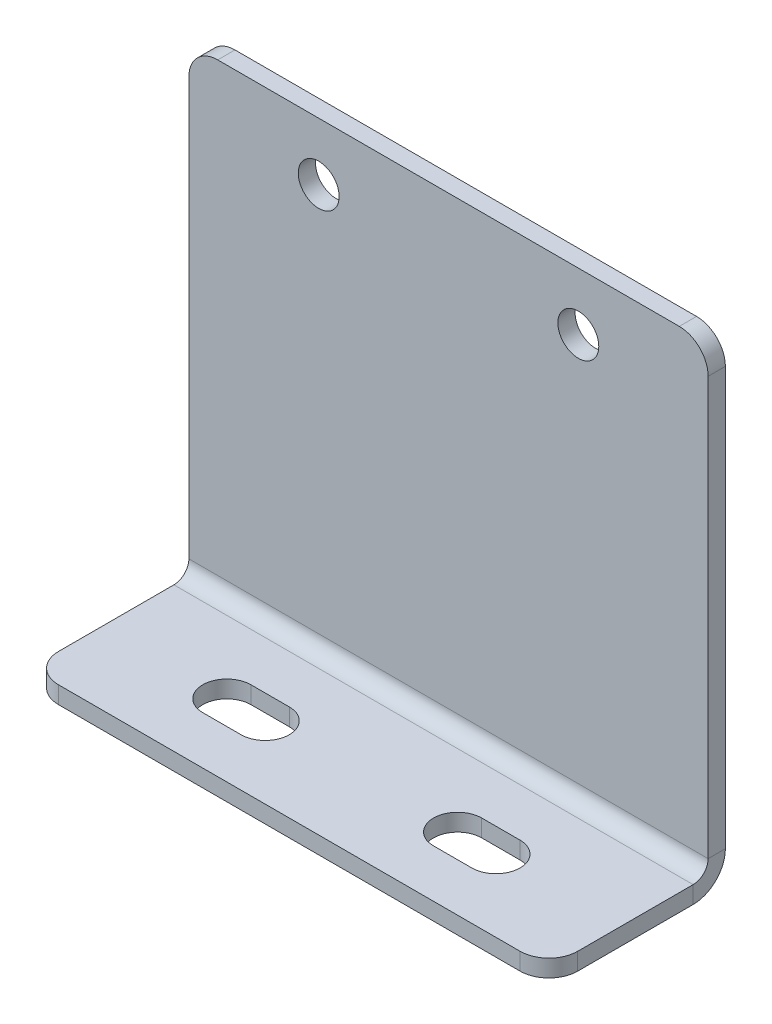
ISO-10303-21;
HEADER;
FILE_DESCRIPTION(('STEP AP214'),'2;1');
FILE_NAME('part.step','',(''),(''),'','','');
FILE_SCHEMA(('AUTOMOTIVE_DESIGN { 1 0 10303 214 1 1 1 1 }'));
ENDSEC;
DATA;
#1=APPLICATION_CONTEXT('core data for automotive mechanical design processes');
#2=APPLICATION_PROTOCOL_DEFINITION('international standard','automotive_design',2000,#1);
#3=PRODUCT_CONTEXT('',#1,'mechanical');
#4=PRODUCT('Part','Part','',(#3));
#5=PRODUCT_RELATED_PRODUCT_CATEGORY('part','',(#4));
#6=PRODUCT_DEFINITION_FORMATION('','',#4);
#7=PRODUCT_DEFINITION_CONTEXT('part definition',#1,'design');
#8=PRODUCT_DEFINITION('design','',#6,#7);
#9=PRODUCT_DEFINITION_SHAPE('','',#8);
#10=(LENGTH_UNIT() NAMED_UNIT(*) SI_UNIT(.MILLI.,.METRE.));
#11=(NAMED_UNIT(*) PLANE_ANGLE_UNIT() SI_UNIT($,.RADIAN.));
#12=(NAMED_UNIT(*) SI_UNIT($,.STERADIAN.) SOLID_ANGLE_UNIT());
#13=UNCERTAINTY_MEASURE_WITH_UNIT(LENGTH_MEASURE(1.E-05),#10,'distance_accuracy_value','');
#14=(GEOMETRIC_REPRESENTATION_CONTEXT(3) GLOBAL_UNCERTAINTY_ASSIGNED_CONTEXT((#13)) GLOBAL_UNIT_ASSIGNED_CONTEXT((#10,
#11,#12)) REPRESENTATION_CONTEXT('',''));
#15=CARTESIAN_POINT('',(0.,0.,0.));
#16=DIRECTION('',(0.,0.,1.));
#17=DIRECTION('',(1.,0.,0.));
#18=AXIS2_PLACEMENT_3D('',#15,#16,#17);
#19=CARTESIAN_POINT('',(0.,0.,0.));
#20=DIRECTION('',(0.,-1.,0.));
#21=DIRECTION('',(0.,0.,-1.));
#22=AXIS2_PLACEMENT_3D('',#19,#20,#21);
#23=PLANE('',#22);
#24=DIRECTION('',(1.,0.,0.));
#25=VECTOR('',#24,1.);
#26=CARTESIAN_POINT('',(0.,0.,0.));
#27=LINE('',#26,#25);
#28=CARTESIAN_POINT('',(3.175,0.,0.));
#29=VERTEX_POINT('',#28);
#30=CARTESIAN_POINT('',(53.975,0.,0.));
#31=VERTEX_POINT('',#30);
#32=EDGE_CURVE('E482',#29,#31,#27,.T.);
#33=ORIENTED_EDGE('',*,*,#32,.T.);
#34=CARTESIAN_POINT('',(53.975,0.,-3.175));
#35=DIRECTION('',(0.,-1.,0.));
#36=DIRECTION('',(0.,0.,-1.));
#37=AXIS2_PLACEMENT_3D('',#34,#35,#36);
#38=CIRCLE('',#37,3.175);
#39=CARTESIAN_POINT('',(57.15,0.,-3.175));
#40=VERTEX_POINT('',#39);
#41=EDGE_CURVE('E501',#31,#40,#38,.F.);
#42=ORIENTED_EDGE('',*,*,#41,.T.);
#43=DIRECTION('',(0.,0.,-1.));
#44=VECTOR('',#43,1.);
#45=CARTESIAN_POINT('',(57.15,0.,0.));
#46=LINE('',#45,#44);
#47=CARTESIAN_POINT('',(57.15,0.,-15.875));
#48=VERTEX_POINT('',#47);
#49=EDGE_CURVE('E485',#40,#48,#46,.T.);
#50=ORIENTED_EDGE('',*,*,#49,.T.);
#51=DIRECTION('',(-1.,0.,0.));
#52=VECTOR('',#51,1.);
#53=CARTESIAN_POINT('',(0.,0.,-15.875));
#54=LINE('',#53,#52);
#55=CARTESIAN_POINT('',(0.,0.,-15.875));
#56=VERTEX_POINT('',#55);
#57=EDGE_CURVE('E471',#48,#56,#54,.T.);
#58=ORIENTED_EDGE('',*,*,#57,.T.);
#59=DIRECTION('',(0.,0.,1.));
#60=VECTOR('',#59,1.);
#61=CARTESIAN_POINT('',(0.,0.,0.));
#62=LINE('',#61,#60);
#63=CARTESIAN_POINT('',(0.,0.,-3.175));
#64=VERTEX_POINT('',#63);
#65=EDGE_CURVE('E458',#56,#64,#62,.T.);
#66=ORIENTED_EDGE('',*,*,#65,.T.);
#67=CARTESIAN_POINT('',(3.175,0.,-3.175));
#68=DIRECTION('',(0.,-1.,0.));
#69=DIRECTION('',(0.,0.,-1.));
#70=AXIS2_PLACEMENT_3D('',#67,#68,#69);
#71=CIRCLE('',#70,3.175);
#72=EDGE_CURVE('E499',#64,#29,#71,.F.);
#73=ORIENTED_EDGE('',*,*,#72,.T.);
#74=EDGE_LOOP('',(#33,#42,#50,#58,#66,#73));
#75=FACE_BOUND('',#74,.T.);
#76=DIRECTION('',(1.,0.,0.));
#77=VECTOR('',#76,1.);
#78=CARTESIAN_POINT('',(39.1668,0.,-10.5918));
#79=LINE('',#78,#77);
#80=CARTESIAN_POINT('',(39.1668,0.,-10.5918));
#81=VERTEX_POINT('',#80);
#82=CARTESIAN_POINT('',(43.3832,0.,-10.5918));
#83=VERTEX_POINT('',#82);
#84=EDGE_CURVE('E407',#81,#83,#79,.T.);
#85=ORIENTED_EDGE('',*,*,#84,.T.);
#86=CARTESIAN_POINT('',(43.3832,0.,-7.9375));
#87=DIRECTION('',(0.,1.,0.));
#88=DIRECTION('',(0.,0.,1.));
#89=AXIS2_PLACEMENT_3D('',#86,#87,#88);
#90=CIRCLE('',#89,2.6543);
#91=CARTESIAN_POINT('',(43.3832,0.,-5.28320000000003));
#92=VERTEX_POINT('',#91);
#93=EDGE_CURVE('E420',#92,#83,#90,.T.);
#94=ORIENTED_EDGE('',*,*,#93,.F.);
#95=DIRECTION('',(1.,0.,0.));
#96=VECTOR('',#95,1.);
#97=CARTESIAN_POINT('',(39.1668,0.,-5.28320000000003));
#98=LINE('',#97,#96);
#99=CARTESIAN_POINT('',(39.1668,0.,-5.2832));
#100=VERTEX_POINT('',#99);
#101=EDGE_CURVE('E399',#100,#92,#98,.T.);
#102=ORIENTED_EDGE('',*,*,#101,.F.);
#103=CARTESIAN_POINT('',(39.1668,0.,-7.9375));
#104=DIRECTION('',(0.,1.,0.));
#105=DIRECTION('',(0.,0.,1.));
#106=AXIS2_PLACEMENT_3D('',#103,#104,#105);
#107=CIRCLE('',#106,2.6543);
#108=EDGE_CURVE('E410',#81,#100,#107,.T.);
#109=ORIENTED_EDGE('',*,*,#108,.F.);
#110=EDGE_LOOP('',(#85,#94,#102,#109));
#111=FACE_BOUND('',#110,.T.);
#112=DIRECTION('',(1.,0.,0.));
#113=VECTOR('',#112,1.);
#114=CARTESIAN_POINT('',(13.7668,0.,-5.28320000000003));
#115=LINE('',#114,#113);
#116=CARTESIAN_POINT('',(13.7668,0.,-5.2832));
#117=VERTEX_POINT('',#116);
#118=CARTESIAN_POINT('',(17.9832,0.,-5.28320000000003));
#119=VERTEX_POINT('',#118);
#120=EDGE_CURVE('E385',#117,#119,#115,.T.);
#121=ORIENTED_EDGE('',*,*,#120,.F.);
#122=CARTESIAN_POINT('',(13.7668,0.,-7.9375));
#123=DIRECTION('',(0.,1.,0.));
#124=DIRECTION('',(0.,0.,1.));
#125=AXIS2_PLACEMENT_3D('',#122,#123,#124);
#126=CIRCLE('',#125,2.6543);
#127=CARTESIAN_POINT('',(13.7668,0.,-10.5918));
#128=VERTEX_POINT('',#127);
#129=EDGE_CURVE('E372',#128,#117,#126,.T.);
#130=ORIENTED_EDGE('',*,*,#129,.F.);
#131=DIRECTION('',(1.,0.,0.));
#132=VECTOR('',#131,1.);
#133=CARTESIAN_POINT('',(13.7668,0.,-10.5918));
#134=LINE('',#133,#132);
#135=CARTESIAN_POINT('',(17.9832,0.,-10.5918));
#136=VERTEX_POINT('',#135);
#137=EDGE_CURVE('E362',#128,#136,#134,.T.);
#138=ORIENTED_EDGE('',*,*,#137,.T.);
#139=CARTESIAN_POINT('',(17.9832,0.,-7.9375));
#140=DIRECTION('',(0.,1.,0.));
#141=DIRECTION('',(0.,0.,1.));
#142=AXIS2_PLACEMENT_3D('',#139,#140,#141);
#143=CIRCLE('',#142,2.6543);
#144=EDGE_CURVE('E382',#119,#136,#143,.T.);
#145=ORIENTED_EDGE('',*,*,#144,.F.);
#146=EDGE_LOOP('',(#121,#130,#138,#145));
#147=FACE_BOUND('',#146,.T.);
#148=ADVANCED_FACE('F222',(#75,#111,#147),#23,.F.);
#149=CARTESIAN_POINT('',(0.,-1.89738,0.));
#150=DIRECTION('',(0.,-1.,0.));
#151=DIRECTION('',(0.,0.,-1.));
#152=AXIS2_PLACEMENT_3D('',#149,#150,#151);
#153=PLANE('',#152);
#154=CARTESIAN_POINT('',(17.9832,-1.89738000000002,-7.9375));
#155=DIRECTION('',(0.,1.,0.));
#156=DIRECTION('',(0.,0.,1.));
#157=AXIS2_PLACEMENT_3D('',#154,#155,#156);
#158=CIRCLE('',#157,2.6543);
#159=CARTESIAN_POINT('',(17.9832,-1.89738000000002,-5.2832));
#160=VERTEX_POINT('',#159);
#161=CARTESIAN_POINT('',(17.9832,-1.89738000000002,-10.5918));
#162=VERTEX_POINT('',#161);
#163=EDGE_CURVE('E392',#160,#162,#158,.T.);
#164=ORIENTED_EDGE('',*,*,#163,.T.);
#165=DIRECTION('',(1.,0.,0.));
#166=VECTOR('',#165,1.);
#167=CARTESIAN_POINT('',(13.7668,-1.89738000000002,-10.5918));
#168=LINE('',#167,#166);
#169=CARTESIAN_POINT('',(13.7668,-1.89738000000002,-10.5918));
#170=VERTEX_POINT('',#169);
#171=EDGE_CURVE('E373',#170,#162,#168,.T.);
#172=ORIENTED_EDGE('',*,*,#171,.F.);
#173=CARTESIAN_POINT('',(13.7668,-1.89738000000002,-7.9375));
#174=DIRECTION('',(0.,1.,0.));
#175=DIRECTION('',(0.,0.,1.));
#176=AXIS2_PLACEMENT_3D('',#173,#174,#175);
#177=CIRCLE('',#176,2.6543);
#178=CARTESIAN_POINT('',(13.7668,-1.89738,-5.2832));
#179=VERTEX_POINT('',#178);
#180=EDGE_CURVE('E380',#170,#179,#177,.T.);
#181=ORIENTED_EDGE('',*,*,#180,.T.);
#182=DIRECTION('',(1.,0.,0.));
#183=VECTOR('',#182,1.);
#184=CARTESIAN_POINT('',(13.7668,-1.89738000000002,-5.2832));
#185=LINE('',#184,#183);
#186=EDGE_CURVE('E866',#179,#160,#185,.T.);
#187=ORIENTED_EDGE('',*,*,#186,.T.);
#188=EDGE_LOOP('',(#164,#172,#181,#187));
#189=FACE_BOUND('',#188,.T.);
#190=DIRECTION('',(0.,0.,-1.));
#191=VECTOR('',#190,1.);
#192=CARTESIAN_POINT('',(57.15,-1.89738,0.));
#193=LINE('',#192,#191);
#194=CARTESIAN_POINT('',(57.15,-1.89738,-3.175));
#195=VERTEX_POINT('',#194);
#196=CARTESIAN_POINT('',(57.15,-1.89738,-15.875));
#197=VERTEX_POINT('',#196);
#198=EDGE_CURVE('E474',#195,#197,#193,.T.);
#199=ORIENTED_EDGE('',*,*,#198,.F.);
#200=CARTESIAN_POINT('',(53.975,-1.89738,-3.175));
#201=DIRECTION('',(0.,-1.,0.));
#202=DIRECTION('',(0.,0.,-1.));
#203=AXIS2_PLACEMENT_3D('',#200,#201,#202);
#204=CIRCLE('',#203,3.175);
#205=CARTESIAN_POINT('',(53.975,-1.89738,0.));
#206=VERTEX_POINT('',#205);
#207=EDGE_CURVE('E507',#195,#206,#204,.T.);
#208=ORIENTED_EDGE('',*,*,#207,.T.);
#209=DIRECTION('',(1.,0.,0.));
#210=VECTOR('',#209,1.);
#211=CARTESIAN_POINT('',(0.,-1.89738,0.));
#212=LINE('',#211,#210);
#213=CARTESIAN_POINT('',(3.175,-1.89738,0.));
#214=VERTEX_POINT('',#213);
#215=EDGE_CURVE('E470',#214,#206,#212,.T.);
#216=ORIENTED_EDGE('',*,*,#215,.F.);
#217=CARTESIAN_POINT('',(3.175,-1.89738,-3.175));
#218=DIRECTION('',(0.,-1.,0.));
#219=DIRECTION('',(0.,0.,-1.));
#220=AXIS2_PLACEMENT_3D('',#217,#218,#219);
#221=CIRCLE('',#220,3.175);
#222=CARTESIAN_POINT('',(0.,-1.89738,-3.175));
#223=VERTEX_POINT('',#222);
#224=EDGE_CURVE('E505',#214,#223,#221,.T.);
#225=ORIENTED_EDGE('',*,*,#224,.T.);
#226=DIRECTION('',(0.,0.,1.));
#227=VECTOR('',#226,1.);
#228=CARTESIAN_POINT('',(0.,-1.89738,0.));
#229=LINE('',#228,#227);
#230=CARTESIAN_POINT('',(0.,-1.89738000000002,-15.875));
#231=VERTEX_POINT('',#230);
#232=EDGE_CURVE('E467',#231,#223,#229,.T.);
#233=ORIENTED_EDGE('',*,*,#232,.F.);
#234=DIRECTION('',(-1.,0.,0.));
#235=VECTOR('',#234,1.);
#236=CARTESIAN_POINT('',(0.,-1.89738,-15.875));
#237=LINE('',#236,#235);
#238=EDGE_CURVE('E476',#197,#231,#237,.T.);
#239=ORIENTED_EDGE('',*,*,#238,.F.);
#240=EDGE_LOOP('',(#199,#208,#216,#225,#233,#239));
#241=FACE_BOUND('',#240,.T.);
#242=DIRECTION('',(1.,0.,0.));
#243=VECTOR('',#242,1.);
#244=CARTESIAN_POINT('',(39.1668,-1.89738000000002,-10.5918));
#245=LINE('',#244,#243);
#246=CARTESIAN_POINT('',(39.1668,-1.89738000000002,-10.5918));
#247=VERTEX_POINT('',#246);
#248=CARTESIAN_POINT('',(43.3832,-1.89738,-10.5918));
#249=VERTEX_POINT('',#248);
#250=EDGE_CURVE('E404',#247,#249,#245,.T.);
#251=ORIENTED_EDGE('',*,*,#250,.F.);
#252=CARTESIAN_POINT('',(39.1668,-1.89738000000002,-7.9375));
#253=DIRECTION('',(0.,1.,0.));
#254=DIRECTION('',(0.,0.,1.));
#255=AXIS2_PLACEMENT_3D('',#252,#253,#254);
#256=CIRCLE('',#255,2.6543);
#257=CARTESIAN_POINT('',(39.1668,-1.89738000000002,-5.2832));
#258=VERTEX_POINT('',#257);
#259=EDGE_CURVE('E413',#247,#258,#256,.T.);
#260=ORIENTED_EDGE('',*,*,#259,.T.);
#261=DIRECTION('',(1.,0.,0.));
#262=VECTOR('',#261,1.);
#263=CARTESIAN_POINT('',(39.1668,-1.89738000000002,-5.2832));
#264=LINE('',#263,#262);
#265=CARTESIAN_POINT('',(43.3832,-1.89738000000002,-5.2832));
#266=VERTEX_POINT('',#265);
#267=EDGE_CURVE('E401',#258,#266,#264,.T.);
#268=ORIENTED_EDGE('',*,*,#267,.T.);
#269=CARTESIAN_POINT('',(43.3832,-1.89738000000002,-7.9375));
#270=DIRECTION('',(0.,1.,0.));
#271=DIRECTION('',(0.,0.,1.));
#272=AXIS2_PLACEMENT_3D('',#269,#270,#271);
#273=CIRCLE('',#272,2.6543);
#274=EDGE_CURVE('E423',#266,#249,#273,.T.);
#275=ORIENTED_EDGE('',*,*,#274,.T.);
#276=EDGE_LOOP('',(#251,#260,#268,#275));
#277=FACE_BOUND('',#276,.T.);
#278=ADVANCED_FACE('F573',(#189,#241,#277),#153,.T.);
#279=CARTESIAN_POINT('',(0.,-1.89738,0.));
#280=DIRECTION('',(-1.,0.,0.));
#281=DIRECTION('',(0.,0.,1.));
#282=AXIS2_PLACEMENT_3D('',#279,#280,#281);
#283=PLANE('',#282);
#284=ORIENTED_EDGE('',*,*,#232,.T.);
#285=DIRECTION('',(0.,1.,0.));
#286=VECTOR('',#285,1.);
#287=CARTESIAN_POINT('',(0.,-1.89738,-3.175));
#288=LINE('',#287,#286);
#289=EDGE_CURVE('E16',#223,#64,#288,.T.);
#290=ORIENTED_EDGE('',*,*,#289,.T.);
#291=ORIENTED_EDGE('',*,*,#65,.F.);
#292=DIRECTION('',(0.,1.,0.));
#293=VECTOR('',#292,1.);
#294=CARTESIAN_POINT('',(0.,-1.89738,-15.875));
#295=LINE('',#294,#293);
#296=EDGE_CURVE('E489',#231,#56,#295,.T.);
#297=ORIENTED_EDGE('',*,*,#296,.F.);
#298=EDGE_LOOP('',(#284,#290,#291,#297));
#299=FACE_BOUND('',#298,.T.);
#300=ADVANCED_FACE('F570',(#299),#283,.T.);
#301=CARTESIAN_POINT('',(57.15,-1.89738,0.));
#302=DIRECTION('',(1.,0.,0.));
#303=DIRECTION('',(0.,0.,-1.));
#304=AXIS2_PLACEMENT_3D('',#301,#302,#303);
#305=PLANE('',#304);
#306=ORIENTED_EDGE('',*,*,#49,.F.);
#307=DIRECTION('',(0.,1.,0.));
#308=VECTOR('',#307,1.);
#309=CARTESIAN_POINT('',(57.15,-1.89738,-3.175));
#310=LINE('',#309,#308);
#311=EDGE_CURVE('E503',#40,#195,#310,.F.);
#312=ORIENTED_EDGE('',*,*,#311,.T.);
#313=ORIENTED_EDGE('',*,*,#198,.T.);
#314=DIRECTION('',(0.,1.,0.));
#315=VECTOR('',#314,1.);
#316=CARTESIAN_POINT('',(57.15,-1.89738,-15.875));
#317=LINE('',#316,#315);
#318=EDGE_CURVE('E479',#197,#48,#317,.T.);
#319=ORIENTED_EDGE('',*,*,#318,.T.);
#320=EDGE_LOOP('',(#306,#312,#313,#319));
#321=FACE_BOUND('',#320,.T.);
#322=ADVANCED_FACE('F560',(#321),#305,.T.);
#323=CARTESIAN_POINT('',(0.,-1.89738,0.));
#324=DIRECTION('',(0.,0.,1.));
#325=DIRECTION('',(1.,0.,0.));
#326=AXIS2_PLACEMENT_3D('',#323,#324,#325);
#327=PLANE('',#326);
#328=ORIENTED_EDGE('',*,*,#215,.T.);
#329=DIRECTION('',(0.,1.,0.));
#330=VECTOR('',#329,1.);
#331=CARTESIAN_POINT('',(53.975,-1.89738,0.));
#332=LINE('',#331,#330);
#333=EDGE_CURVE('E496',#206,#31,#332,.T.);
#334=ORIENTED_EDGE('',*,*,#333,.T.);
#335=ORIENTED_EDGE('',*,*,#32,.F.);
#336=DIRECTION('',(0.,1.,0.));
#337=VECTOR('',#336,1.);
#338=CARTESIAN_POINT('',(3.175,-1.89738,0.));
#339=LINE('',#338,#337);
#340=EDGE_CURVE('E492',#29,#214,#339,.F.);
#341=ORIENTED_EDGE('',*,*,#340,.T.);
#342=EDGE_LOOP('',(#328,#334,#335,#341));
#343=FACE_BOUND('',#342,.T.);
#344=ADVANCED_FACE('F582',(#343),#327,.T.);
#345=CARTESIAN_POINT('',(57.15,1.65099999999998,-15.875));
#346=DIRECTION('',(1.,0.,0.));
#347=DIRECTION('',(0.,0.,-1.));
#348=AXIS2_PLACEMENT_3D('',#345,#346,#347);
#349=PLANE('',#348);
#350=DIRECTION('',(0.,0.,1.));
#351=VECTOR('',#350,1.);
#352=CARTESIAN_POINT('',(57.15,1.65100000000001,-19.42338));
#353=LINE('',#352,#351);
#354=CARTESIAN_POINT('',(57.15,1.65099999999998,-17.526));
#355=VERTEX_POINT('',#354);
#356=CARTESIAN_POINT('',(57.15,1.65099999999997,-19.42338));
#357=VERTEX_POINT('',#356);
#358=EDGE_CURVE('E431',#355,#357,#353,.F.);
#359=ORIENTED_EDGE('',*,*,#358,.F.);
#360=CARTESIAN_POINT('',(57.15,1.65099999999998,-15.875));
#361=DIRECTION('',(-1.,0.,0.));
#362=DIRECTION('',(0.,0.,1.));
#363=AXIS2_PLACEMENT_3D('',#360,#361,#362);
#364=CIRCLE('',#363,1.651);
#365=EDGE_CURVE('E462',#48,#355,#364,.F.);
#366=ORIENTED_EDGE('',*,*,#365,.F.);
#367=ORIENTED_EDGE('',*,*,#318,.F.);
#368=CARTESIAN_POINT('',(57.15,1.65099999999998,-15.875));
#369=DIRECTION('',(-1.,0.,0.));
#370=DIRECTION('',(0.,0.,1.));
#371=AXIS2_PLACEMENT_3D('',#368,#369,#370);
#372=CIRCLE('',#371,3.54838);
#373=EDGE_CURVE('E455',#197,#357,#372,.F.);
#374=ORIENTED_EDGE('',*,*,#373,.T.);
#375=EDGE_LOOP('',(#359,#366,#367,#374));
#376=FACE_BOUND('',#375,.T.);
#377=ADVANCED_FACE('F555',(#376),#349,.T.);
#378=CARTESIAN_POINT('',(0.,1.65099999999998,-15.875));
#379=DIRECTION('',(1.,0.,0.));
#380=DIRECTION('',(0.,0.,-1.));
#381=AXIS2_PLACEMENT_3D('',#378,#379,#380);
#382=PLANE('',#381);
#383=CARTESIAN_POINT('',(0.,1.65099999999998,-15.875));
#384=DIRECTION('',(-1.,0.,0.));
#385=DIRECTION('',(0.,0.,1.));
#386=AXIS2_PLACEMENT_3D('',#383,#384,#385);
#387=CIRCLE('',#386,1.651);
#388=CARTESIAN_POINT('',(0.,1.65099999999998,-17.526));
#389=VERTEX_POINT('',#388);
#390=EDGE_CURVE('E434',#389,#56,#387,.T.);
#391=ORIENTED_EDGE('',*,*,#390,.F.);
#392=DIRECTION('',(0.,0.,1.));
#393=VECTOR('',#392,1.);
#394=CARTESIAN_POINT('',(0.,1.65099999999999,-17.526));
#395=LINE('',#394,#393);
#396=CARTESIAN_POINT('',(0.,1.65100000000001,-19.42338));
#397=VERTEX_POINT('',#396);
#398=EDGE_CURVE('E448',#389,#397,#395,.F.);
#399=ORIENTED_EDGE('',*,*,#398,.T.);
#400=CARTESIAN_POINT('',(0.,1.65099999999998,-15.875));
#401=DIRECTION('',(-1.,0.,0.));
#402=DIRECTION('',(0.,0.,1.));
#403=AXIS2_PLACEMENT_3D('',#400,#401,#402);
#404=CIRCLE('',#403,3.54838);
#405=EDGE_CURVE('E459',#397,#231,#404,.T.);
#406=ORIENTED_EDGE('',*,*,#405,.T.);
#407=ORIENTED_EDGE('',*,*,#296,.T.);
#408=EDGE_LOOP('',(#391,#399,#406,#407));
#409=FACE_BOUND('',#408,.T.);
#410=ADVANCED_FACE('F549',(#409),#382,.F.);
#411=CARTESIAN_POINT('',(0.,1.65099999999998,-15.875));
#412=DIRECTION('',(-1.,0.,0.));
#413=DIRECTION('',(0.,0.,-1.));
#414=AXIS2_PLACEMENT_3D('',#411,#412,#413);
#415=CYLINDRICAL_SURFACE('',#414,3.54838);
#416=ORIENTED_EDGE('',*,*,#238,.T.);
#417=ORIENTED_EDGE('',*,*,#405,.F.);
#418=DIRECTION('',(-1.,0.,0.));
#419=VECTOR('',#418,1.);
#420=CARTESIAN_POINT('',(57.15,1.65100000000001,-19.42338));
#421=LINE('',#420,#419);
#422=EDGE_CURVE('E445',#397,#357,#421,.F.);
#423=ORIENTED_EDGE('',*,*,#422,.T.);
#424=ORIENTED_EDGE('',*,*,#373,.F.);
#425=EDGE_LOOP('',(#416,#417,#423,#424));
#426=FACE_BOUND('',#425,.T.);
#427=ADVANCED_FACE('F552',(#426),#415,.T.);
#428=CARTESIAN_POINT('',(0.,1.65099999999998,-15.875));
#429=DIRECTION('',(-1.,0.,0.));
#430=DIRECTION('',(0.,0.,-1.));
#431=AXIS2_PLACEMENT_3D('',#428,#429,#430);
#432=CYLINDRICAL_SURFACE('',#431,1.651);
#433=ORIENTED_EDGE('',*,*,#57,.F.);
#434=ORIENTED_EDGE('',*,*,#365,.T.);
#435=DIRECTION('',(-1.,0.,0.));
#436=VECTOR('',#435,1.);
#437=CARTESIAN_POINT('',(57.15,1.65099999999999,-17.526));
#438=LINE('',#437,#436);
#439=EDGE_CURVE('E451',#355,#389,#438,.T.);
#440=ORIENTED_EDGE('',*,*,#439,.T.);
#441=ORIENTED_EDGE('',*,*,#390,.T.);
#442=EDGE_LOOP('',(#433,#434,#440,#441));
#443=FACE_BOUND('',#442,.T.);
#444=ADVANCED_FACE('F565',(#443),#432,.F.);
#445=CARTESIAN_POINT('',(0.,50.8,-19.4233800000002));
#446=DIRECTION('',(1.,0.,0.));
#447=DIRECTION('',(0.,0.,-1.));
#448=AXIS2_PLACEMENT_3D('',#445,#446,#447);
#449=PLANE('',#448);
#450=DIRECTION('',(0.,-1.,0.));
#451=VECTOR('',#450,1.);
#452=CARTESIAN_POINT('',(0.,50.8,-17.5260000000002));
#453=LINE('',#452,#451);
#454=CARTESIAN_POINT('',(0.,47.625,-17.5260000000002));
#455=VERTEX_POINT('',#454);
#456=EDGE_CURVE('E443',#389,#455,#453,.F.);
#457=ORIENTED_EDGE('',*,*,#456,.T.);
#458=DIRECTION('',(0.,0.,1.));
#459=VECTOR('',#458,1.);
#460=CARTESIAN_POINT('',(0.,47.625,-19.4233800000002));
#461=LINE('',#460,#459);
#462=CARTESIAN_POINT('',(0.,47.625,-19.4233800000002));
#463=VERTEX_POINT('',#462);
#464=EDGE_CURVE('E230',#455,#463,#461,.F.);
#465=ORIENTED_EDGE('',*,*,#464,.T.);
#466=DIRECTION('',(0.,1.,0.));
#467=VECTOR('',#466,1.);
#468=CARTESIAN_POINT('',(0.,0.,-19.42338));
#469=LINE('',#468,#467);
#470=EDGE_CURVE('E437',#397,#463,#469,.T.);
#471=ORIENTED_EDGE('',*,*,#470,.F.);
#472=ORIENTED_EDGE('',*,*,#398,.F.);
#473=EDGE_LOOP('',(#457,#465,#471,#472));
#474=FACE_BOUND('',#473,.T.);
#475=ADVANCED_FACE('F546',(#474),#449,.F.);
#476=CARTESIAN_POINT('',(57.15,0.,-19.42338));
#477=DIRECTION('',(-1.,0.,0.));
#478=DIRECTION('',(0.,0.,1.));
#479=AXIS2_PLACEMENT_3D('',#476,#477,#478);
#480=PLANE('',#479);
#481=DIRECTION('',(0.,-1.,0.));
#482=VECTOR('',#481,1.);
#483=CARTESIAN_POINT('',(57.15,0.,-19.42338));
#484=LINE('',#483,#482);
#485=CARTESIAN_POINT('',(57.15,47.625,-19.4233800000002));
#486=VERTEX_POINT('',#485);
#487=EDGE_CURVE('E432',#486,#357,#484,.T.);
#488=ORIENTED_EDGE('',*,*,#487,.F.);
#489=DIRECTION('',(0.,0.,1.));
#490=VECTOR('',#489,1.);
#491=CARTESIAN_POINT('',(57.15,47.625,-19.4233800000002));
#492=LINE('',#491,#490);
#493=CARTESIAN_POINT('',(57.15,47.625,-17.5260000000002));
#494=VERTEX_POINT('',#493);
#495=EDGE_CURVE('E509',#486,#494,#492,.T.);
#496=ORIENTED_EDGE('',*,*,#495,.T.);
#497=DIRECTION('',(0.,1.,0.));
#498=VECTOR('',#497,1.);
#499=CARTESIAN_POINT('',(57.15,0.,-17.526));
#500=LINE('',#499,#498);
#501=EDGE_CURVE('E439',#494,#355,#500,.F.);
#502=ORIENTED_EDGE('',*,*,#501,.T.);
#503=ORIENTED_EDGE('',*,*,#358,.T.);
#504=EDGE_LOOP('',(#488,#496,#502,#503));
#505=FACE_BOUND('',#504,.T.);
#506=ADVANCED_FACE('F531',(#505),#480,.F.);
#507=CARTESIAN_POINT('',(0.,0.,-19.42338));
#508=DIRECTION('',(0.,0.,1.));
#509=DIRECTION('',(0.,-1.,0.));
#510=AXIS2_PLACEMENT_3D('',#507,#508,#509);
#511=PLANE('',#510);
#512=CARTESIAN_POINT('',(14.2875,44.45,-19.4233800000002));
#513=DIRECTION('',(0.,0.,1.));
#514=DIRECTION('',(1.,0.,0.));
#515=AXIS2_PLACEMENT_3D('',#512,#513,#514);
#516=CIRCLE('',#515,2.25);
#517=CARTESIAN_POINT('',(16.5375,44.45,-19.4233800000002));
#518=VERTEX_POINT('',#517);
#519=EDGE_CURVE('E876',#518,#518,#516,.T.);
#520=ORIENTED_EDGE('',*,*,#519,.T.);
#521=EDGE_LOOP('',(#520));
#522=FACE_BOUND('',#521,.T.);
#523=CARTESIAN_POINT('',(42.8625,44.45,-19.4233800000002));
#524=DIRECTION('',(0.,0.,1.));
#525=DIRECTION('',(1.,0.,0.));
#526=AXIS2_PLACEMENT_3D('',#523,#524,#525);
#527=CIRCLE('',#526,2.25);
#528=CARTESIAN_POINT('',(45.1125,44.45,-19.4233800000002));
#529=VERTEX_POINT('',#528);
#530=EDGE_CURVE('E868',#529,#529,#527,.T.);
#531=ORIENTED_EDGE('',*,*,#530,.T.);
#532=EDGE_LOOP('',(#531));
#533=FACE_BOUND('',#532,.T.);
#534=DIRECTION('',(1.,0.,0.));
#535=VECTOR('',#534,1.);
#536=CARTESIAN_POINT('',(0.,50.8,-19.4233800000002));
#537=LINE('',#536,#535);
#538=CARTESIAN_POINT('',(3.175,50.8,-19.4233800000002));
#539=VERTEX_POINT('',#538);
#540=CARTESIAN_POINT('',(53.975,50.8,-19.4233800000002));
#541=VERTEX_POINT('',#540);
#542=EDGE_CURVE('E435',#539,#541,#537,.T.);
#543=ORIENTED_EDGE('',*,*,#542,.T.);
#544=CARTESIAN_POINT('',(53.975,47.625,-19.4233800000002));
#545=DIRECTION('',(0.,0.,1.));
#546=DIRECTION('',(0.,-1.,0.));
#547=AXIS2_PLACEMENT_3D('',#544,#545,#546);
#548=CIRCLE('',#547,3.175);
#549=EDGE_CURVE('E522',#541,#486,#548,.F.);
#550=ORIENTED_EDGE('',*,*,#549,.T.);
#551=ORIENTED_EDGE('',*,*,#487,.T.);
#552=ORIENTED_EDGE('',*,*,#422,.F.);
#553=ORIENTED_EDGE('',*,*,#470,.T.);
#554=CARTESIAN_POINT('',(3.175,47.625,-19.4233800000002));
#555=DIRECTION('',(0.,0.,1.));
#556=DIRECTION('',(0.,-1.,0.));
#557=AXIS2_PLACEMENT_3D('',#554,#555,#556);
#558=CIRCLE('',#557,3.175);
#559=EDGE_CURVE('E520',#463,#539,#558,.F.);
#560=ORIENTED_EDGE('',*,*,#559,.T.);
#561=EDGE_LOOP('',(#543,#550,#551,#552,#553,#560));
#562=FACE_BOUND('',#561,.T.);
#563=ADVANCED_FACE('F526',(#522,#533,#562),#511,.F.);
#564=CARTESIAN_POINT('',(0.,0.,-17.526));
#565=DIRECTION('',(0.,0.,1.));
#566=DIRECTION('',(0.,-1.,0.));
#567=AXIS2_PLACEMENT_3D('',#564,#565,#566);
#568=PLANE('',#567);
#569=CARTESIAN_POINT('',(14.2875,44.45,-17.526));
#570=DIRECTION('',(0.,0.,1.));
#571=DIRECTION('',(1.,0.,0.));
#572=AXIS2_PLACEMENT_3D('',#569,#570,#571);
#573=CIRCLE('',#572,2.25);
#574=CARTESIAN_POINT('',(16.5375,44.45,-17.526));
#575=VERTEX_POINT('',#574);
#576=EDGE_CURVE('E879',#575,#575,#573,.T.);
#577=ORIENTED_EDGE('',*,*,#576,.F.);
#578=EDGE_LOOP('',(#577));
#579=FACE_BOUND('',#578,.T.);
#580=CARTESIAN_POINT('',(42.8625,44.45,-17.526));
#581=DIRECTION('',(0.,0.,1.));
#582=DIRECTION('',(1.,0.,0.));
#583=AXIS2_PLACEMENT_3D('',#580,#581,#582);
#584=CIRCLE('',#583,2.25);
#585=CARTESIAN_POINT('',(45.1125,44.45,-17.526));
#586=VERTEX_POINT('',#585);
#587=EDGE_CURVE('E873',#586,#586,#584,.T.);
#588=ORIENTED_EDGE('',*,*,#587,.F.);
#589=EDGE_LOOP('',(#588));
#590=FACE_BOUND('',#589,.T.);
#591=ORIENTED_EDGE('',*,*,#501,.F.);
#592=CARTESIAN_POINT('',(53.975,47.625,-17.5260000000002));
#593=DIRECTION('',(0.,0.,1.));
#594=DIRECTION('',(0.,-1.,0.));
#595=AXIS2_PLACEMENT_3D('',#592,#593,#594);
#596=CIRCLE('',#595,3.175);
#597=CARTESIAN_POINT('',(53.975,50.8,-17.5260000000002));
#598=VERTEX_POINT('',#597);
#599=EDGE_CURVE('E514',#494,#598,#596,.T.);
#600=ORIENTED_EDGE('',*,*,#599,.T.);
#601=DIRECTION('',(-1.,0.,0.));
#602=VECTOR('',#601,1.);
#603=CARTESIAN_POINT('',(57.15,50.8,-17.5260000000002));
#604=LINE('',#603,#602);
#605=CARTESIAN_POINT('',(3.175,50.8,-17.5260000000002));
#606=VERTEX_POINT('',#605);
#607=EDGE_CURVE('E441',#606,#598,#604,.F.);
#608=ORIENTED_EDGE('',*,*,#607,.F.);
#609=CARTESIAN_POINT('',(3.175,47.625,-17.5260000000002));
#610=DIRECTION('',(0.,0.,1.));
#611=DIRECTION('',(0.,-1.,0.));
#612=AXIS2_PLACEMENT_3D('',#609,#610,#611);
#613=CIRCLE('',#612,3.175);
#614=EDGE_CURVE('E512',#606,#455,#613,.T.);
#615=ORIENTED_EDGE('',*,*,#614,.T.);
#616=ORIENTED_EDGE('',*,*,#456,.F.);
#617=ORIENTED_EDGE('',*,*,#439,.F.);
#618=EDGE_LOOP('',(#591,#600,#608,#615,#616,#617));
#619=FACE_BOUND('',#618,.T.);
#620=ADVANCED_FACE('F537',(#579,#590,#619),#568,.T.);
#621=CARTESIAN_POINT('',(57.15,50.8,-19.4233800000002));
#622=DIRECTION('',(0.,-1.,0.));
#623=DIRECTION('',(0.,0.,-1.));
#624=AXIS2_PLACEMENT_3D('',#621,#622,#623);
#625=PLANE('',#624);
#626=ORIENTED_EDGE('',*,*,#607,.T.);
#627=DIRECTION('',(0.,0.,1.));
#628=VECTOR('',#627,1.);
#629=CARTESIAN_POINT('',(53.975,50.8,-19.4233800000002));
#630=LINE('',#629,#628);
#631=EDGE_CURVE('E244',#598,#541,#630,.F.);
#632=ORIENTED_EDGE('',*,*,#631,.T.);
#633=ORIENTED_EDGE('',*,*,#542,.F.);
#634=DIRECTION('',(0.,0.,1.));
#635=VECTOR('',#634,1.);
#636=CARTESIAN_POINT('',(3.175,50.8,-19.4233800000002));
#637=LINE('',#636,#635);
#638=EDGE_CURVE('E516',#539,#606,#637,.T.);
#639=ORIENTED_EDGE('',*,*,#638,.T.);
#640=EDGE_LOOP('',(#626,#632,#633,#639));
#641=FACE_BOUND('',#640,.T.);
#642=ADVANCED_FACE('F539',(#641),#625,.F.);
#643=CARTESIAN_POINT('',(43.3832,0.,-7.9375));
#644=DIRECTION('',(0.,1.,0.));
#645=DIRECTION('',(0.,0.,1.));
#646=AXIS2_PLACEMENT_3D('',#643,#644,#645);
#647=CYLINDRICAL_SURFACE('',#646,2.6543);
#648=ORIENTED_EDGE('',*,*,#274,.F.);
#649=DIRECTION('',(0.,1.,0.));
#650=VECTOR('',#649,1.);
#651=CARTESIAN_POINT('',(43.3832,0.,-5.2832));
#652=LINE('',#651,#650);
#653=EDGE_CURVE('E428',#92,#266,#652,.F.);
#654=ORIENTED_EDGE('',*,*,#653,.F.);
#655=ORIENTED_EDGE('',*,*,#93,.T.);
#656=DIRECTION('',(0.,1.,0.));
#657=VECTOR('',#656,1.);
#658=CARTESIAN_POINT('',(43.3832,0.,-10.5918));
#659=LINE('',#658,#657);
#660=EDGE_CURVE('E426',#249,#83,#659,.T.);
#661=ORIENTED_EDGE('',*,*,#660,.F.);
#662=EDGE_LOOP('',(#648,#654,#655,#661));
#663=FACE_BOUND('',#662,.T.);
#664=ADVANCED_FACE('F657',(#663),#647,.F.);
#665=CARTESIAN_POINT('',(39.1668,0.,-7.9375));
#666=DIRECTION('',(0.,1.,0.));
#667=DIRECTION('',(0.,0.,1.));
#668=AXIS2_PLACEMENT_3D('',#665,#666,#667);
#669=CYLINDRICAL_SURFACE('',#668,2.6543);
#670=ORIENTED_EDGE('',*,*,#108,.T.);
#671=DIRECTION('',(0.,1.,0.));
#672=VECTOR('',#671,1.);
#673=CARTESIAN_POINT('',(39.1668,0.,-5.2832));
#674=LINE('',#673,#672);
#675=EDGE_CURVE('E416',#258,#100,#674,.T.);
#676=ORIENTED_EDGE('',*,*,#675,.F.);
#677=ORIENTED_EDGE('',*,*,#259,.F.);
#678=DIRECTION('',(0.,1.,0.));
#679=VECTOR('',#678,1.);
#680=CARTESIAN_POINT('',(39.1668,0.,-10.5918));
#681=LINE('',#680,#679);
#682=EDGE_CURVE('E418',#81,#247,#681,.F.);
#683=ORIENTED_EDGE('',*,*,#682,.F.);
#684=EDGE_LOOP('',(#670,#676,#677,#683));
#685=FACE_BOUND('',#684,.T.);
#686=ADVANCED_FACE('F746',(#685),#669,.F.);
#687=CARTESIAN_POINT('',(39.1668,0.,-10.5918));
#688=DIRECTION('',(0.,0.,-1.));
#689=DIRECTION('',(-1.,0.,0.));
#690=AXIS2_PLACEMENT_3D('',#687,#688,#689);
#691=PLANE('',#690);
#692=ORIENTED_EDGE('',*,*,#660,.T.);
#693=ORIENTED_EDGE('',*,*,#84,.F.);
#694=ORIENTED_EDGE('',*,*,#682,.T.);
#695=ORIENTED_EDGE('',*,*,#250,.T.);
#696=EDGE_LOOP('',(#692,#693,#694,#695));
#697=FACE_BOUND('',#696,.T.);
#698=ADVANCED_FACE('F737',(#697),#691,.F.);
#699=CARTESIAN_POINT('',(39.1668,0.,-5.2832));
#700=DIRECTION('',(0.,0.,1.));
#701=DIRECTION('',(1.,0.,0.));
#702=AXIS2_PLACEMENT_3D('',#699,#700,#701);
#703=PLANE('',#702);
#704=ORIENTED_EDGE('',*,*,#653,.T.);
#705=ORIENTED_EDGE('',*,*,#267,.F.);
#706=ORIENTED_EDGE('',*,*,#675,.T.);
#707=ORIENTED_EDGE('',*,*,#101,.T.);
#708=EDGE_LOOP('',(#704,#705,#706,#707));
#709=FACE_BOUND('',#708,.T.);
#710=ADVANCED_FACE('F728',(#709),#703,.F.);
#711=CARTESIAN_POINT('',(17.9832,0.,-7.9375));
#712=DIRECTION('',(0.,1.,0.));
#713=DIRECTION('',(0.,0.,1.));
#714=AXIS2_PLACEMENT_3D('',#711,#712,#713);
#715=CYLINDRICAL_SURFACE('',#714,2.6543);
#716=ORIENTED_EDGE('',*,*,#163,.F.);
#717=DIRECTION('',(0.,1.,0.));
#718=VECTOR('',#717,1.);
#719=CARTESIAN_POINT('',(17.9832,0.,-5.2832));
#720=LINE('',#719,#718);
#721=EDGE_CURVE('E396',#119,#160,#720,.F.);
#722=ORIENTED_EDGE('',*,*,#721,.F.);
#723=ORIENTED_EDGE('',*,*,#144,.T.);
#724=DIRECTION('',(0.,1.,0.));
#725=VECTOR('',#724,1.);
#726=CARTESIAN_POINT('',(17.9832,0.,-10.5918));
#727=LINE('',#726,#725);
#728=EDGE_CURVE('E368',#162,#136,#727,.T.);
#729=ORIENTED_EDGE('',*,*,#728,.F.);
#730=EDGE_LOOP('',(#716,#722,#723,#729));
#731=FACE_BOUND('',#730,.T.);
#732=ADVANCED_FACE('F720',(#731),#715,.F.);
#733=CARTESIAN_POINT('',(13.7668,0.,-7.9375));
#734=DIRECTION('',(0.,1.,0.));
#735=DIRECTION('',(0.,0.,1.));
#736=AXIS2_PLACEMENT_3D('',#733,#734,#735);
#737=CYLINDRICAL_SURFACE('',#736,2.6543);
#738=ORIENTED_EDGE('',*,*,#129,.T.);
#739=DIRECTION('',(0.,1.,0.));
#740=VECTOR('',#739,1.);
#741=CARTESIAN_POINT('',(13.7668,0.,-5.2832));
#742=LINE('',#741,#740);
#743=EDGE_CURVE('E383',#179,#117,#742,.T.);
#744=ORIENTED_EDGE('',*,*,#743,.F.);
#745=ORIENTED_EDGE('',*,*,#180,.F.);
#746=DIRECTION('',(0.,1.,0.));
#747=VECTOR('',#746,1.);
#748=CARTESIAN_POINT('',(13.7668,0.,-10.5918));
#749=LINE('',#748,#747);
#750=EDGE_CURVE('E365',#128,#170,#749,.F.);
#751=ORIENTED_EDGE('',*,*,#750,.F.);
#752=EDGE_LOOP('',(#738,#744,#745,#751));
#753=FACE_BOUND('',#752,.T.);
#754=ADVANCED_FACE('F377',(#753),#737,.F.);
#755=CARTESIAN_POINT('',(13.7668,0.,-10.5918));
#756=DIRECTION('',(0.,0.,-1.));
#757=DIRECTION('',(-1.,0.,0.));
#758=AXIS2_PLACEMENT_3D('',#755,#756,#757);
#759=PLANE('',#758);
#760=ORIENTED_EDGE('',*,*,#728,.T.);
#761=ORIENTED_EDGE('',*,*,#137,.F.);
#762=ORIENTED_EDGE('',*,*,#750,.T.);
#763=ORIENTED_EDGE('',*,*,#171,.T.);
#764=EDGE_LOOP('',(#760,#761,#762,#763));
#765=FACE_BOUND('',#764,.T.);
#766=ADVANCED_FACE('F364',(#765),#759,.F.);
#767=CARTESIAN_POINT('',(13.7668,0.,-5.2832));
#768=DIRECTION('',(0.,0.,1.));
#769=DIRECTION('',(1.,0.,0.));
#770=AXIS2_PLACEMENT_3D('',#767,#768,#769);
#771=PLANE('',#770);
#772=ORIENTED_EDGE('',*,*,#721,.T.);
#773=ORIENTED_EDGE('',*,*,#186,.F.);
#774=ORIENTED_EDGE('',*,*,#743,.T.);
#775=ORIENTED_EDGE('',*,*,#120,.T.);
#776=EDGE_LOOP('',(#772,#773,#774,#775));
#777=FACE_BOUND('',#776,.T.);
#778=ADVANCED_FACE('F696',(#777),#771,.F.);
#779=CARTESIAN_POINT('',(42.8625,44.45,-17.526));
#780=DIRECTION('',(0.,0.,1.));
#781=DIRECTION('',(1.,0.,0.));
#782=AXIS2_PLACEMENT_3D('',#779,#780,#781);
#783=CYLINDRICAL_SURFACE('',#782,2.25);
#784=ORIENTED_EDGE('',*,*,#530,.F.);
#785=EDGE_LOOP('',(#784));
#786=FACE_BOUND('',#785,.T.);
#787=ORIENTED_EDGE('',*,*,#587,.T.);
#788=EDGE_LOOP('',(#787));
#789=FACE_BOUND('',#788,.T.);
#790=ADVANCED_FACE('F594',(#786,#789),#783,.F.);
#791=CARTESIAN_POINT('',(14.2875,44.45,-17.526));
#792=DIRECTION('',(0.,0.,1.));
#793=DIRECTION('',(1.,0.,0.));
#794=AXIS2_PLACEMENT_3D('',#791,#792,#793);
#795=CYLINDRICAL_SURFACE('',#794,2.25);
#796=ORIENTED_EDGE('',*,*,#519,.F.);
#797=EDGE_LOOP('',(#796));
#798=FACE_BOUND('',#797,.T.);
#799=ORIENTED_EDGE('',*,*,#576,.T.);
#800=EDGE_LOOP('',(#799));
#801=FACE_BOUND('',#800,.T.);
#802=ADVANCED_FACE('F587',(#798,#801),#795,.F.);
#803=CARTESIAN_POINT('',(53.975,-1.89738,-3.175));
#804=DIRECTION('',(0.,1.,0.));
#805=DIRECTION('',(0.,0.,1.));
#806=AXIS2_PLACEMENT_3D('',#803,#804,#805);
#807=CYLINDRICAL_SURFACE('',#806,3.175);
#808=ORIENTED_EDGE('',*,*,#207,.F.);
#809=ORIENTED_EDGE('',*,*,#311,.F.);
#810=ORIENTED_EDGE('',*,*,#41,.F.);
#811=ORIENTED_EDGE('',*,*,#333,.F.);
#812=EDGE_LOOP('',(#808,#809,#810,#811));
#813=FACE_BOUND('',#812,.T.);
#814=ADVANCED_FACE('F585',(#813),#807,.T.);
#815=CARTESIAN_POINT('',(53.975,47.625,-19.4233800000002));
#816=DIRECTION('',(0.,0.,1.));
#817=DIRECTION('',(0.,-1.,0.));
#818=AXIS2_PLACEMENT_3D('',#815,#816,#817);
#819=CYLINDRICAL_SURFACE('',#818,3.175);
#820=ORIENTED_EDGE('',*,*,#549,.F.);
#821=ORIENTED_EDGE('',*,*,#631,.F.);
#822=ORIENTED_EDGE('',*,*,#599,.F.);
#823=ORIENTED_EDGE('',*,*,#495,.F.);
#824=EDGE_LOOP('',(#820,#821,#822,#823));
#825=FACE_BOUND('',#824,.T.);
#826=ADVANCED_FACE('F534',(#825),#819,.T.);
#827=CARTESIAN_POINT('',(3.175,47.625,-19.4233800000002));
#828=DIRECTION('',(0.,0.,1.));
#829=DIRECTION('',(0.,-1.,0.));
#830=AXIS2_PLACEMENT_3D('',#827,#828,#829);
#831=CYLINDRICAL_SURFACE('',#830,3.175);
#832=ORIENTED_EDGE('',*,*,#559,.F.);
#833=ORIENTED_EDGE('',*,*,#464,.F.);
#834=ORIENTED_EDGE('',*,*,#614,.F.);
#835=ORIENTED_EDGE('',*,*,#638,.F.);
#836=EDGE_LOOP('',(#832,#833,#834,#835));
#837=FACE_BOUND('',#836,.T.);
#838=ADVANCED_FACE('F543',(#837),#831,.T.);
#839=CARTESIAN_POINT('',(3.175,-1.89738,-3.175));
#840=DIRECTION('',(0.,1.,0.));
#841=DIRECTION('',(0.,0.,1.));
#842=AXIS2_PLACEMENT_3D('',#839,#840,#841);
#843=CYLINDRICAL_SURFACE('',#842,3.175);
#844=ORIENTED_EDGE('',*,*,#224,.F.);
#845=ORIENTED_EDGE('',*,*,#340,.F.);
#846=ORIENTED_EDGE('',*,*,#72,.F.);
#847=ORIENTED_EDGE('',*,*,#289,.F.);
#848=EDGE_LOOP('',(#844,#845,#846,#847));
#849=FACE_BOUND('',#848,.T.);
#850=ADVANCED_FACE('F224',(#849),#843,.T.);
#851=CLOSED_SHELL('',(#148,#278,#300,#322,#344,#377,#410,#427,#444,#475,#506,#563,#620,#642,
#664,#686,#698,#710,#732,#754,#766,#778,#790,#802,#814,#826,#838,#850));
#852=MANIFOLD_SOLID_BREP('B2',#851);
#853=ADVANCED_BREP_SHAPE_REPRESENTATION('',(#18,#852),#14);
#854=SHAPE_DEFINITION_REPRESENTATION(#9,#853);
ENDSEC;
END-ISO-10303-21;
